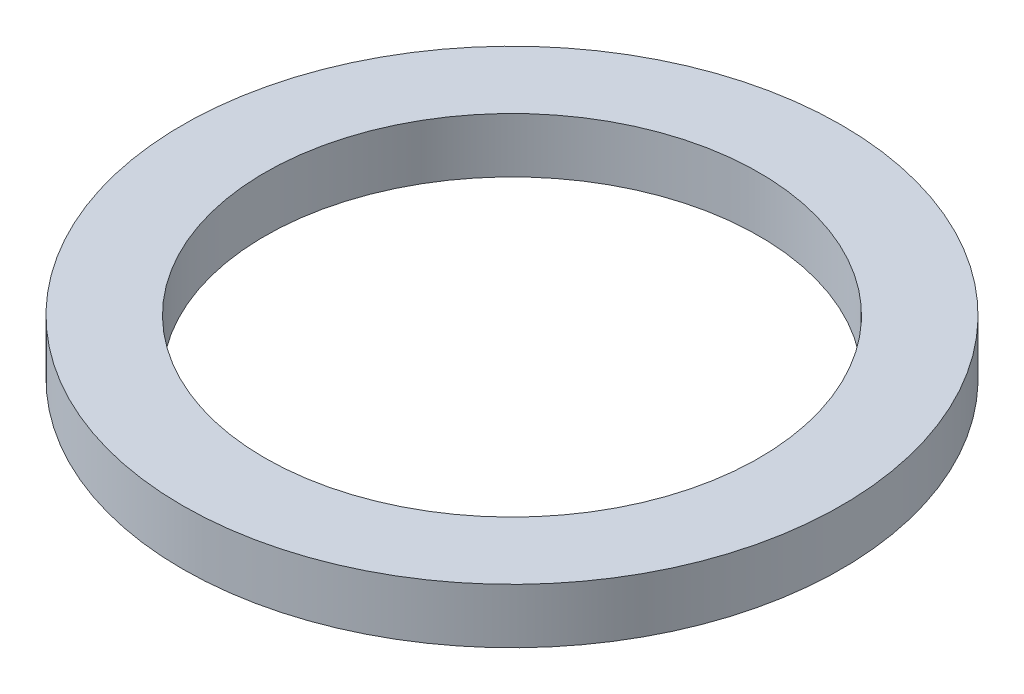
ISO-10303-21;
HEADER;
FILE_DESCRIPTION(('STEP AP214'),'2;1');
FILE_NAME('part.step','',(''),(''),'','','');
FILE_SCHEMA(('AUTOMOTIVE_DESIGN { 1 0 10303 214 1 1 1 1 }'));
ENDSEC;
DATA;
#1=APPLICATION_CONTEXT('core data for automotive mechanical design processes');
#2=APPLICATION_PROTOCOL_DEFINITION('international standard','automotive_design',2000,#1);
#3=PRODUCT_CONTEXT('',#1,'mechanical');
#4=PRODUCT('Part','Part','',(#3));
#5=PRODUCT_RELATED_PRODUCT_CATEGORY('part','',(#4));
#6=PRODUCT_DEFINITION_FORMATION('','',#4);
#7=PRODUCT_DEFINITION_CONTEXT('part definition',#1,'design');
#8=PRODUCT_DEFINITION('design','',#6,#7);
#9=PRODUCT_DEFINITION_SHAPE('','',#8);
#10=(LENGTH_UNIT() NAMED_UNIT(*) SI_UNIT(.MILLI.,.METRE.));
#11=(NAMED_UNIT(*) PLANE_ANGLE_UNIT() SI_UNIT($,.RADIAN.));
#12=(NAMED_UNIT(*) SI_UNIT($,.STERADIAN.) SOLID_ANGLE_UNIT());
#13=UNCERTAINTY_MEASURE_WITH_UNIT(LENGTH_MEASURE(1.E-05),#10,'distance_accuracy_value','');
#14=(GEOMETRIC_REPRESENTATION_CONTEXT(3) GLOBAL_UNCERTAINTY_ASSIGNED_CONTEXT((#13)) GLOBAL_UNIT_ASSIGNED_CONTEXT((#10,
#11,#12)) REPRESENTATION_CONTEXT('',''));
#15=CARTESIAN_POINT('',(0.,0.,0.));
#16=DIRECTION('',(0.,0.,1.));
#17=DIRECTION('',(1.,0.,0.));
#18=AXIS2_PLACEMENT_3D('',#15,#16,#17);
#19=CARTESIAN_POINT('',(0.,5.,0.));
#20=DIRECTION('',(0.,-1.,0.));
#21=DIRECTION('',(0.,0.,-1.));
#22=AXIS2_PLACEMENT_3D('',#19,#20,#21);
#23=CYLINDRICAL_SURFACE('',#22,30.);
#24=CARTESIAN_POINT('',(0.,5.,0.));
#25=DIRECTION('',(0.,1.,0.));
#26=DIRECTION('',(0.,0.,1.));
#27=AXIS2_PLACEMENT_3D('',#24,#25,#26);
#28=CIRCLE('',#27,30.);
#29=CARTESIAN_POINT('',(0.,5.,30.));
#30=VERTEX_POINT('',#29);
#31=EDGE_CURVE('E10',#30,#30,#28,.T.);
#32=ORIENTED_EDGE('',*,*,#31,.F.);
#33=EDGE_LOOP('',(#32));
#34=FACE_BOUND('',#33,.T.);
#35=CARTESIAN_POINT('',(0.,0.,0.));
#36=DIRECTION('',(0.,1.,0.));
#37=DIRECTION('',(0.,0.,1.));
#38=AXIS2_PLACEMENT_3D('',#35,#36,#37);
#39=CIRCLE('',#38,30.);
#40=CARTESIAN_POINT('',(0.,0.,30.));
#41=VERTEX_POINT('',#40);
#42=EDGE_CURVE('E37',#41,#41,#39,.T.);
#43=ORIENTED_EDGE('',*,*,#42,.T.);
#44=EDGE_LOOP('',(#43));
#45=FACE_BOUND('',#44,.T.);
#46=ADVANCED_FACE('F40',(#34,#45),#23,.T.);
#47=CARTESIAN_POINT('',(0.,5.,0.));
#48=DIRECTION('',(0.,1.,0.));
#49=DIRECTION('',(0.,0.,1.));
#50=AXIS2_PLACEMENT_3D('',#47,#48,#49);
#51=PLANE('',#50);
#52=CARTESIAN_POINT('',(0.,5.,0.));
#53=DIRECTION('',(0.,1.,0.));
#54=DIRECTION('',(0.,0.,1.));
#55=AXIS2_PLACEMENT_3D('',#52,#53,#54);
#56=CIRCLE('',#55,22.5);
#57=CARTESIAN_POINT('',(0.,5.,22.5));
#58=VERTEX_POINT('',#57);
#59=EDGE_CURVE('E50',#58,#58,#56,.T.);
#60=ORIENTED_EDGE('',*,*,#59,.F.);
#61=EDGE_LOOP('',(#60));
#62=FACE_BOUND('',#61,.T.);
#63=ORIENTED_EDGE('',*,*,#31,.T.);
#64=EDGE_LOOP('',(#63));
#65=FACE_BOUND('',#64,.T.);
#66=ADVANCED_FACE('F59',(#62,#65),#51,.T.);
#67=CARTESIAN_POINT('',(0.,0.,0.));
#68=DIRECTION('',(0.,1.,0.));
#69=DIRECTION('',(0.,0.,1.));
#70=AXIS2_PLACEMENT_3D('',#67,#68,#69);
#71=PLANE('',#70);
#72=CARTESIAN_POINT('',(0.,0.,0.));
#73=DIRECTION('',(0.,1.,0.));
#74=DIRECTION('',(0.,0.,1.));
#75=AXIS2_PLACEMENT_3D('',#72,#73,#74);
#76=CIRCLE('',#75,22.5);
#77=CARTESIAN_POINT('',(0.,0.,22.5));
#78=VERTEX_POINT('',#77);
#79=EDGE_CURVE('E47',#78,#78,#76,.T.);
#80=ORIENTED_EDGE('',*,*,#79,.T.);
#81=EDGE_LOOP('',(#80));
#82=FACE_BOUND('',#81,.T.);
#83=ORIENTED_EDGE('',*,*,#42,.F.);
#84=EDGE_LOOP('',(#83));
#85=FACE_BOUND('',#84,.T.);
#86=ADVANCED_FACE('F58',(#82,#85),#71,.F.);
#87=CARTESIAN_POINT('',(0.,5.,0.));
#88=DIRECTION('',(0.,-1.,0.));
#89=DIRECTION('',(0.,0.,-1.));
#90=AXIS2_PLACEMENT_3D('',#87,#88,#89);
#91=CYLINDRICAL_SURFACE('',#90,22.5);
#92=ORIENTED_EDGE('',*,*,#59,.T.);
#93=EDGE_LOOP('',(#92));
#94=FACE_BOUND('',#93,.T.);
#95=ORIENTED_EDGE('',*,*,#79,.F.);
#96=EDGE_LOOP('',(#95));
#97=FACE_BOUND('',#96,.T.);
#98=ADVANCED_FACE('F54',(#94,#97),#91,.F.);
#99=CLOSED_SHELL('',(#46,#66,#86,#98));
#100=MANIFOLD_SOLID_BREP('B2',#99);
#101=ADVANCED_BREP_SHAPE_REPRESENTATION('',(#18,#100),#14);
#102=SHAPE_DEFINITION_REPRESENTATION(#9,#101);
ENDSEC;
END-ISO-10303-21;
